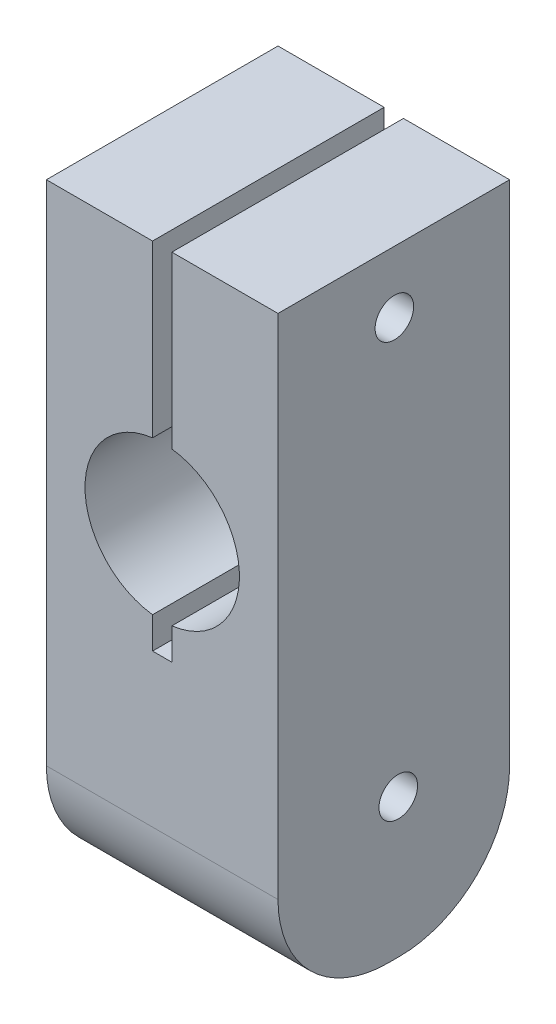
ISO-10303-21;
HEADER;
FILE_DESCRIPTION(('STEP AP214'),'2;1');
FILE_NAME('part.step','',(''),(''),'','','');
FILE_SCHEMA(('AUTOMOTIVE_DESIGN { 1 0 10303 214 1 1 1 1 }'));
ENDSEC;
DATA;
#1=APPLICATION_CONTEXT('core data for automotive mechanical design processes');
#2=APPLICATION_PROTOCOL_DEFINITION('international standard','automotive_design',2000,#1);
#3=PRODUCT_CONTEXT('',#1,'mechanical');
#4=PRODUCT('Part','Part','',(#3));
#5=PRODUCT_RELATED_PRODUCT_CATEGORY('part','',(#4));
#6=PRODUCT_DEFINITION_FORMATION('','',#4);
#7=PRODUCT_DEFINITION_CONTEXT('part definition',#1,'design');
#8=PRODUCT_DEFINITION('design','',#6,#7);
#9=PRODUCT_DEFINITION_SHAPE('','',#8);
#10=(LENGTH_UNIT() NAMED_UNIT(*) SI_UNIT(.MILLI.,.METRE.));
#11=(NAMED_UNIT(*) PLANE_ANGLE_UNIT() SI_UNIT($,.RADIAN.));
#12=(NAMED_UNIT(*) SI_UNIT($,.STERADIAN.) SOLID_ANGLE_UNIT());
#13=UNCERTAINTY_MEASURE_WITH_UNIT(LENGTH_MEASURE(1.E-05),#10,'distance_accuracy_value','');
#14=(GEOMETRIC_REPRESENTATION_CONTEXT(3) GLOBAL_UNCERTAINTY_ASSIGNED_CONTEXT((#13)) GLOBAL_UNIT_ASSIGNED_CONTEXT((#10,
#11,#12)) REPRESENTATION_CONTEXT('',''));
#15=CARTESIAN_POINT('',(0.,0.,0.));
#16=DIRECTION('',(0.,0.,1.));
#17=DIRECTION('',(1.,0.,0.));
#18=AXIS2_PLACEMENT_3D('',#15,#16,#17);
#19=CARTESIAN_POINT('',(0.79375,21.59,-9.525));
#20=DIRECTION('',(1.,0.,0.));
#21=DIRECTION('',(0.,0.,-1.));
#22=AXIS2_PLACEMENT_3D('',#19,#20,#21);
#23=PLANE('',#22);
#24=CARTESIAN_POINT('',(0.793749999999999,45.7202220572897,-0.0474979236769172));
#25=DIRECTION('',(1.,0.,0.));
#26=DIRECTION('',(0.,0.,-1.));
#27=AXIS2_PLACEMENT_3D('',#24,#25,#26);
#28=CIRCLE('',#27,1.5875);
#29=CARTESIAN_POINT('',(0.793749999999999,45.7202220572897,-1.63499792367692));
#30=VERTEX_POINT('',#29);
#31=EDGE_CURVE('E250',#30,#30,#28,.T.);
#32=ORIENTED_EDGE('',*,*,#31,.T.);
#33=EDGE_LOOP('',(#32));
#34=FACE_BOUND('',#33,.T.);
#35=DIRECTION('',(0.,1.,0.));
#36=VECTOR('',#35,1.);
#37=CARTESIAN_POINT('',(0.79375,21.59,-9.525));
#38=LINE('',#37,#36);
#39=CARTESIAN_POINT('',(0.79375,36.7801953094726,-9.525));
#40=VERTEX_POINT('',#39);
#41=CARTESIAN_POINT('',(0.79375,50.8,-9.525));
#42=VERTEX_POINT('',#41);
#43=EDGE_CURVE('E176',#40,#42,#38,.T.);
#44=ORIENTED_EDGE('',*,*,#43,.F.);
#45=DIRECTION('',(0.,0.,1.));
#46=VECTOR('',#45,1.);
#47=CARTESIAN_POINT('',(0.79375,36.7801953094726,-9.526));
#48=LINE('',#47,#46);
#49=CARTESIAN_POINT('',(0.79375,36.7801953094726,9.525));
#50=VERTEX_POINT('',#49);
#51=EDGE_CURVE('E255',#50,#40,#48,.F.);
#52=ORIENTED_EDGE('',*,*,#51,.F.);
#53=DIRECTION('',(0.,1.,0.));
#54=VECTOR('',#53,1.);
#55=CARTESIAN_POINT('',(0.79375,21.59,9.525));
#56=LINE('',#55,#54);
#57=CARTESIAN_POINT('',(0.79375,50.8,9.525));
#58=VERTEX_POINT('',#57);
#59=EDGE_CURVE('E164',#50,#58,#56,.T.);
#60=ORIENTED_EDGE('',*,*,#59,.T.);
#61=DIRECTION('',(0.,0.,-1.));
#62=VECTOR('',#61,1.);
#63=CARTESIAN_POINT('',(0.79375,50.8,-9.525));
#64=LINE('',#63,#62);
#65=EDGE_CURVE('E254',#58,#42,#64,.T.);
#66=ORIENTED_EDGE('',*,*,#65,.T.);
#67=EDGE_LOOP('',(#44,#52,#60,#66));
#68=FACE_BOUND('',#67,.T.);
#69=ADVANCED_FACE('F35',(#34,#68),#23,.F.);
#70=CARTESIAN_POINT('',(-0.79375,21.59,-9.525));
#71=DIRECTION('',(-1.,0.,0.));
#72=DIRECTION('',(0.,0.,1.));
#73=AXIS2_PLACEMENT_3D('',#70,#71,#72);
#74=PLANE('',#73);
#75=DIRECTION('',(0.,1.,0.));
#76=VECTOR('',#75,1.);
#77=CARTESIAN_POINT('',(-0.79375,21.59,-9.525));
#78=LINE('',#77,#76);
#79=CARTESIAN_POINT('',(-0.79375,21.59,-9.525));
#80=VERTEX_POINT('',#79);
#81=CARTESIAN_POINT('',(-0.79375,24.1798046905274,-9.525));
#82=VERTEX_POINT('',#81);
#83=EDGE_CURVE('E156',#80,#82,#78,.T.);
#84=ORIENTED_EDGE('',*,*,#83,.T.);
#85=DIRECTION('',(0.,0.,1.));
#86=VECTOR('',#85,1.);
#87=CARTESIAN_POINT('',(-0.79375,24.1798046905274,-9.526));
#88=LINE('',#87,#86);
#89=CARTESIAN_POINT('',(-0.79375,24.1798046905274,9.525));
#90=VERTEX_POINT('',#89);
#91=EDGE_CURVE('E141',#90,#82,#88,.F.);
#92=ORIENTED_EDGE('',*,*,#91,.F.);
#93=DIRECTION('',(0.,1.,0.));
#94=VECTOR('',#93,1.);
#95=CARTESIAN_POINT('',(-0.79375,21.59,9.525));
#96=LINE('',#95,#94);
#97=CARTESIAN_POINT('',(-0.79375,21.59,9.525));
#98=VERTEX_POINT('',#97);
#99=EDGE_CURVE('E153',#98,#90,#96,.T.);
#100=ORIENTED_EDGE('',*,*,#99,.F.);
#101=DIRECTION('',(0.,0.,1.));
#102=VECTOR('',#101,1.);
#103=CARTESIAN_POINT('',(-0.79375,21.59,-9.525));
#104=LINE('',#103,#102);
#105=EDGE_CURVE('E266',#80,#98,#104,.T.);
#106=ORIENTED_EDGE('',*,*,#105,.F.);
#107=EDGE_LOOP('',(#84,#92,#100,#106));
#108=FACE_BOUND('',#107,.T.);
#109=ADVANCED_FACE('F152',(#108),#74,.F.);
#110=CARTESIAN_POINT('',(0.,50.8,0.));
#111=DIRECTION('',(0.,1.,0.));
#112=DIRECTION('',(0.,0.,1.));
#113=AXIS2_PLACEMENT_3D('',#110,#111,#112);
#114=PLANE('',#113);
#115=ORIENTED_EDGE('',*,*,#65,.F.);
#116=DIRECTION('',(1.,0.,0.));
#117=VECTOR('',#116,1.);
#118=CARTESIAN_POINT('',(-9.52499999999998,50.8,9.525));
#119=LINE('',#118,#117);
#120=CARTESIAN_POINT('',(9.52500000000001,50.8,9.525));
#121=VERTEX_POINT('',#120);
#122=EDGE_CURVE('E187',#58,#121,#119,.T.);
#123=ORIENTED_EDGE('',*,*,#122,.T.);
#124=DIRECTION('',(0.,0.,-1.));
#125=VECTOR('',#124,1.);
#126=CARTESIAN_POINT('',(9.52500000000001,50.8,-9.525));
#127=LINE('',#126,#125);
#128=CARTESIAN_POINT('',(9.52500000000001,50.8,-9.525));
#129=VERTEX_POINT('',#128);
#130=EDGE_CURVE('E177',#121,#129,#127,.T.);
#131=ORIENTED_EDGE('',*,*,#130,.T.);
#132=DIRECTION('',(-1.,0.,0.));
#133=VECTOR('',#132,1.);
#134=CARTESIAN_POINT('',(-9.52499999999998,50.8,-9.525));
#135=LINE('',#134,#133);
#136=EDGE_CURVE('E182',#129,#42,#135,.T.);
#137=ORIENTED_EDGE('',*,*,#136,.T.);
#138=EDGE_LOOP('',(#115,#123,#131,#137));
#139=FACE_BOUND('',#138,.T.);
#140=ADVANCED_FACE('F277',(#139),#114,.T.);
#141=CARTESIAN_POINT('',(9.52500000000001,50.8,-9.525));
#142=DIRECTION('',(-1.,0.,0.));
#143=DIRECTION('',(0.,0.,1.));
#144=AXIS2_PLACEMENT_3D('',#141,#142,#143);
#145=PLANE('',#144);
#146=CARTESIAN_POINT('',(9.52500000000001,45.7202220572897,-0.0474979236769172));
#147=DIRECTION('',(1.,0.,0.));
#148=DIRECTION('',(0.,0.,-1.));
#149=AXIS2_PLACEMENT_3D('',#146,#147,#148);
#150=CIRCLE('',#149,1.5875);
#151=CARTESIAN_POINT('',(9.52500000000001,45.7202220572897,-1.63499792367692));
#152=VERTEX_POINT('',#151);
#153=EDGE_CURVE('E332',#152,#152,#150,.T.);
#154=ORIENTED_EDGE('',*,*,#153,.F.);
#155=EDGE_LOOP('',(#154));
#156=FACE_BOUND('',#155,.T.);
#157=CARTESIAN_POINT('',(9.52500000000001,11.4317209439949,-0.368108908496109));
#158=DIRECTION('',(1.,0.,0.));
#159=DIRECTION('',(0.,0.,-1.));
#160=AXIS2_PLACEMENT_3D('',#157,#158,#159);
#161=CIRCLE('',#160,1.5875);
#162=CARTESIAN_POINT('',(9.52500000000001,11.4317209439949,-1.95560890849611));
#163=VERTEX_POINT('',#162);
#164=EDGE_CURVE('E335',#163,#163,#161,.T.);
#165=ORIENTED_EDGE('',*,*,#164,.F.);
#166=EDGE_LOOP('',(#165));
#167=FACE_BOUND('',#166,.T.);
#168=DIRECTION('',(0.,0.,-1.));
#169=VECTOR('',#168,1.);
#170=CARTESIAN_POINT('',(9.52500000000001,0.,-9.525));
#171=LINE('',#170,#169);
#172=CARTESIAN_POINT('',(9.52500000000001,0.,0.474999999999998));
#173=VERTEX_POINT('',#172);
#174=CARTESIAN_POINT('',(9.52500000000001,0.,-0.474999999999998));
#175=VERTEX_POINT('',#174);
#176=EDGE_CURVE('E192',#173,#175,#171,.T.);
#177=ORIENTED_EDGE('',*,*,#176,.T.);
#178=CARTESIAN_POINT('',(9.52500000000001,9.05,-0.474999999999998));
#179=DIRECTION('',(-1.,0.,0.));
#180=DIRECTION('',(0.,0.,1.));
#181=AXIS2_PLACEMENT_3D('',#178,#179,#180);
#182=CIRCLE('',#181,9.05);
#183=CARTESIAN_POINT('',(9.52500000000001,9.05,-9.525));
#184=VERTEX_POINT('',#183);
#185=EDGE_CURVE('E44',#175,#184,#182,.F.);
#186=ORIENTED_EDGE('',*,*,#185,.T.);
#187=DIRECTION('',(0.,-1.,0.));
#188=VECTOR('',#187,1.);
#189=CARTESIAN_POINT('',(9.52500000000001,50.8,-9.525));
#190=LINE('',#189,#188);
#191=EDGE_CURVE('E203',#129,#184,#190,.T.);
#192=ORIENTED_EDGE('',*,*,#191,.F.);
#193=ORIENTED_EDGE('',*,*,#130,.F.);
#194=DIRECTION('',(0.,-1.,0.));
#195=VECTOR('',#194,1.);
#196=CARTESIAN_POINT('',(9.52500000000001,50.8,9.525));
#197=LINE('',#196,#195);
#198=CARTESIAN_POINT('',(9.52500000000001,9.05,9.525));
#199=VERTEX_POINT('',#198);
#200=EDGE_CURVE('E191',#121,#199,#197,.T.);
#201=ORIENTED_EDGE('',*,*,#200,.T.);
#202=CARTESIAN_POINT('',(9.52500000000001,9.05,0.474999999999998));
#203=DIRECTION('',(-1.,0.,0.));
#204=DIRECTION('',(0.,0.,1.));
#205=AXIS2_PLACEMENT_3D('',#202,#203,#204);
#206=CIRCLE('',#205,9.05);
#207=EDGE_CURVE('E51',#199,#173,#206,.F.);
#208=ORIENTED_EDGE('',*,*,#207,.T.);
#209=EDGE_LOOP('',(#177,#186,#192,#193,#201,#208));
#210=FACE_BOUND('',#209,.T.);
#211=ADVANCED_FACE('F220',(#156,#167,#210),#145,.F.);
#212=CARTESIAN_POINT('',(-9.52499999999998,50.8,-9.525));
#213=DIRECTION('',(0.,0.,1.));
#214=DIRECTION('',(1.,0.,0.));
#215=AXIS2_PLACEMENT_3D('',#212,#213,#214);
#216=PLANE('',#215);
#217=ORIENTED_EDGE('',*,*,#191,.T.);
#218=DIRECTION('',(-1.,0.,0.));
#219=VECTOR('',#218,1.);
#220=CARTESIAN_POINT('',(-9.52499999999998,9.05,-9.525));
#221=LINE('',#220,#219);
#222=CARTESIAN_POINT('',(-9.52499999999998,9.05,-9.525));
#223=VERTEX_POINT('',#222);
#224=EDGE_CURVE('E206',#184,#223,#221,.T.);
#225=ORIENTED_EDGE('',*,*,#224,.T.);
#226=DIRECTION('',(0.,-1.,0.));
#227=VECTOR('',#226,1.);
#228=CARTESIAN_POINT('',(-9.52499999999998,50.8,-9.525));
#229=LINE('',#228,#227);
#230=CARTESIAN_POINT('',(-9.52499999999998,50.8,-9.525));
#231=VERTEX_POINT('',#230);
#232=EDGE_CURVE('E200',#231,#223,#229,.T.);
#233=ORIENTED_EDGE('',*,*,#232,.F.);
#234=CARTESIAN_POINT('',(-0.793749999999999,50.8,-9.525));
#235=VERTEX_POINT('',#234);
#236=EDGE_CURVE('E180',#235,#231,#135,.T.);
#237=ORIENTED_EDGE('',*,*,#236,.F.);
#238=CARTESIAN_POINT('',(-0.79375,36.7801953094725,-9.525));
#239=VERTEX_POINT('',#238);
#240=EDGE_CURVE('E172',#239,#235,#78,.T.);
#241=ORIENTED_EDGE('',*,*,#240,.F.);
#242=CARTESIAN_POINT('',(0.,30.48,-9.525));
#243=DIRECTION('',(0.,0.,1.));
#244=DIRECTION('',(1.,0.,0.));
#245=AXIS2_PLACEMENT_3D('',#242,#243,#244);
#246=CIRCLE('',#245,6.35);
#247=EDGE_CURVE('E148',#82,#239,#246,.F.);
#248=ORIENTED_EDGE('',*,*,#247,.F.);
#249=ORIENTED_EDGE('',*,*,#83,.F.);
#250=DIRECTION('',(-1.,0.,0.));
#251=VECTOR('',#250,1.);
#252=CARTESIAN_POINT('',(-0.79375,21.59,-9.525));
#253=LINE('',#252,#251);
#254=CARTESIAN_POINT('',(0.79375,21.59,-9.525));
#255=VERTEX_POINT('',#254);
#256=EDGE_CURVE('E263',#255,#80,#253,.T.);
#257=ORIENTED_EDGE('',*,*,#256,.F.);
#258=CARTESIAN_POINT('',(0.79375,24.1798046905274,-9.525));
#259=VERTEX_POINT('',#258);
#260=EDGE_CURVE('E173',#255,#259,#38,.T.);
#261=ORIENTED_EDGE('',*,*,#260,.T.);
#262=CARTESIAN_POINT('',(0.,30.48,-9.525));
#263=DIRECTION('',(0.,0.,1.));
#264=DIRECTION('',(1.,0.,0.));
#265=AXIS2_PLACEMENT_3D('',#262,#263,#264);
#266=CIRCLE('',#265,6.35);
#267=EDGE_CURVE('E257',#40,#259,#266,.F.);
#268=ORIENTED_EDGE('',*,*,#267,.F.);
#269=ORIENTED_EDGE('',*,*,#43,.T.);
#270=ORIENTED_EDGE('',*,*,#136,.F.);
#271=EDGE_LOOP('',(#217,#225,#233,#237,#241,#248,#249,#257,#261,#268,#269,#270));
#272=FACE_BOUND('',#271,.T.);
#273=ADVANCED_FACE('F225',(#272),#216,.F.);
#274=CARTESIAN_POINT('',(-9.52499999999998,50.8,-9.525));
#275=DIRECTION('',(1.,0.,0.));
#276=DIRECTION('',(0.,0.,-1.));
#277=AXIS2_PLACEMENT_3D('',#274,#275,#276);
#278=PLANE('',#277);
#279=CARTESIAN_POINT('',(-9.52499999999998,45.7202220572897,-0.0474979236769172));
#280=DIRECTION('',(1.,0.,0.));
#281=DIRECTION('',(0.,0.,-1.));
#282=AXIS2_PLACEMENT_3D('',#279,#280,#281);
#283=CIRCLE('',#282,1.5875);
#284=CARTESIAN_POINT('',(-9.52499999999998,45.7202220572897,-1.63499792367692));
#285=VERTEX_POINT('',#284);
#286=EDGE_CURVE('E341',#285,#285,#283,.F.);
#287=ORIENTED_EDGE('',*,*,#286,.F.);
#288=EDGE_LOOP('',(#287));
#289=FACE_BOUND('',#288,.T.);
#290=CARTESIAN_POINT('',(-9.52499999999998,11.4317209439949,-0.368108908496109));
#291=DIRECTION('',(1.,0.,0.));
#292=DIRECTION('',(0.,0.,-1.));
#293=AXIS2_PLACEMENT_3D('',#290,#291,#292);
#294=CIRCLE('',#293,1.5875);
#295=CARTESIAN_POINT('',(-9.52499999999998,11.4317209439949,-1.95560890849611));
#296=VERTEX_POINT('',#295);
#297=EDGE_CURVE('E337',#296,#296,#294,.F.);
#298=ORIENTED_EDGE('',*,*,#297,.F.);
#299=EDGE_LOOP('',(#298));
#300=FACE_BOUND('',#299,.T.);
#301=ORIENTED_EDGE('',*,*,#232,.T.);
#302=CARTESIAN_POINT('',(-9.52499999999998,9.05,-0.474999999999998));
#303=DIRECTION('',(1.,0.,0.));
#304=DIRECTION('',(0.,0.,-1.));
#305=AXIS2_PLACEMENT_3D('',#302,#303,#304);
#306=CIRCLE('',#305,9.05);
#307=CARTESIAN_POINT('',(-9.52499999999998,0.,-0.474999999999998));
#308=VERTEX_POINT('',#307);
#309=EDGE_CURVE('E211',#223,#308,#306,.F.);
#310=ORIENTED_EDGE('',*,*,#309,.T.);
#311=DIRECTION('',(0.,0.,1.));
#312=VECTOR('',#311,1.);
#313=CARTESIAN_POINT('',(-9.52499999999998,0.,-9.525));
#314=LINE('',#313,#312);
#315=CARTESIAN_POINT('',(-9.52499999999998,0.,0.474999999999998));
#316=VERTEX_POINT('',#315);
#317=EDGE_CURVE('E181',#308,#316,#314,.T.);
#318=ORIENTED_EDGE('',*,*,#317,.T.);
#319=CARTESIAN_POINT('',(-9.52499999999998,9.05,0.474999999999998));
#320=DIRECTION('',(1.,0.,0.));
#321=DIRECTION('',(0.,0.,-1.));
#322=AXIS2_PLACEMENT_3D('',#319,#320,#321);
#323=CIRCLE('',#322,9.05);
#324=CARTESIAN_POINT('',(-9.52499999999998,9.05,9.525));
#325=VERTEX_POINT('',#324);
#326=EDGE_CURVE('E209',#316,#325,#323,.F.);
#327=ORIENTED_EDGE('',*,*,#326,.T.);
#328=DIRECTION('',(0.,-1.,0.));
#329=VECTOR('',#328,1.);
#330=CARTESIAN_POINT('',(-9.52499999999998,50.8,9.525));
#331=LINE('',#330,#329);
#332=CARTESIAN_POINT('',(-9.52499999999998,50.8,9.525));
#333=VERTEX_POINT('',#332);
#334=EDGE_CURVE('E198',#333,#325,#331,.T.);
#335=ORIENTED_EDGE('',*,*,#334,.F.);
#336=DIRECTION('',(0.,0.,1.));
#337=VECTOR('',#336,1.);
#338=CARTESIAN_POINT('',(-9.52499999999998,50.8,-9.525));
#339=LINE('',#338,#337);
#340=EDGE_CURVE('E185',#231,#333,#339,.T.);
#341=ORIENTED_EDGE('',*,*,#340,.F.);
#342=EDGE_LOOP('',(#301,#310,#318,#327,#335,#341));
#343=FACE_BOUND('',#342,.T.);
#344=ADVANCED_FACE('F229',(#289,#300,#343),#278,.F.);
#345=CARTESIAN_POINT('',(-9.52499999999998,50.8,9.525));
#346=DIRECTION('',(0.,0.,-1.));
#347=DIRECTION('',(-1.,0.,0.));
#348=AXIS2_PLACEMENT_3D('',#345,#346,#347);
#349=PLANE('',#348);
#350=ORIENTED_EDGE('',*,*,#334,.T.);
#351=DIRECTION('',(1.,0.,0.));
#352=VECTOR('',#351,1.);
#353=CARTESIAN_POINT('',(-9.52499999999998,9.05,9.525));
#354=LINE('',#353,#352);
#355=EDGE_CURVE('E11',#325,#199,#354,.T.);
#356=ORIENTED_EDGE('',*,*,#355,.T.);
#357=ORIENTED_EDGE('',*,*,#200,.F.);
#358=ORIENTED_EDGE('',*,*,#122,.F.);
#359=ORIENTED_EDGE('',*,*,#59,.F.);
#360=CARTESIAN_POINT('',(0.,30.48,9.525));
#361=DIRECTION('',(0.,0.,1.));
#362=DIRECTION('',(1.,0.,0.));
#363=AXIS2_PLACEMENT_3D('',#360,#361,#362);
#364=CIRCLE('',#363,6.35);
#365=CARTESIAN_POINT('',(0.79375,24.1798046905274,9.525));
#366=VERTEX_POINT('',#365);
#367=EDGE_CURVE('E245',#366,#50,#364,.T.);
#368=ORIENTED_EDGE('',*,*,#367,.F.);
#369=CARTESIAN_POINT('',(0.79375,21.59,9.525));
#370=VERTEX_POINT('',#369);
#371=EDGE_CURVE('E167',#370,#366,#56,.T.);
#372=ORIENTED_EDGE('',*,*,#371,.F.);
#373=DIRECTION('',(1.,0.,0.));
#374=VECTOR('',#373,1.);
#375=CARTESIAN_POINT('',(-0.79375,21.59,9.525));
#376=LINE('',#375,#374);
#377=EDGE_CURVE('E163',#98,#370,#376,.T.);
#378=ORIENTED_EDGE('',*,*,#377,.F.);
#379=ORIENTED_EDGE('',*,*,#99,.T.);
#380=CARTESIAN_POINT('',(0.,30.48,9.525));
#381=DIRECTION('',(0.,0.,1.));
#382=DIRECTION('',(1.,0.,0.));
#383=AXIS2_PLACEMENT_3D('',#380,#381,#382);
#384=CIRCLE('',#383,6.35);
#385=CARTESIAN_POINT('',(-0.79375,36.7801953094726,9.525));
#386=VERTEX_POINT('',#385);
#387=EDGE_CURVE('E138',#386,#90,#384,.T.);
#388=ORIENTED_EDGE('',*,*,#387,.F.);
#389=CARTESIAN_POINT('',(-0.79375,50.8,9.525));
#390=VERTEX_POINT('',#389);
#391=EDGE_CURVE('E165',#386,#390,#96,.T.);
#392=ORIENTED_EDGE('',*,*,#391,.T.);
#393=EDGE_CURVE('E188',#333,#390,#119,.T.);
#394=ORIENTED_EDGE('',*,*,#393,.F.);
#395=EDGE_LOOP('',(#350,#356,#357,#358,#359,#368,#372,#378,#379,#388,#392,#394));
#396=FACE_BOUND('',#395,.T.);
#397=ADVANCED_FACE('F160',(#396),#349,.F.);
#398=DIRECTION('',(0.,0.,1.));
#399=VECTOR('',#398,1.);
#400=CARTESIAN_POINT('',(-0.79375,50.8,-9.525));
#401=LINE('',#400,#399);
#402=EDGE_CURVE('E240',#235,#390,#401,.T.);
#403=ORIENTED_EDGE('',*,*,#402,.F.);
#404=ORIENTED_EDGE('',*,*,#236,.T.);
#405=ORIENTED_EDGE('',*,*,#340,.T.);
#406=ORIENTED_EDGE('',*,*,#393,.T.);
#407=EDGE_LOOP('',(#403,#404,#405,#406));
#408=FACE_BOUND('',#407,.T.);
#409=ADVANCED_FACE('F239',(#408),#114,.T.);
#410=CARTESIAN_POINT('',(0.,0.,0.));
#411=DIRECTION('',(0.,1.,0.));
#412=DIRECTION('',(0.,0.,1.));
#413=AXIS2_PLACEMENT_3D('',#410,#411,#412);
#414=PLANE('',#413);
#415=ORIENTED_EDGE('',*,*,#317,.F.);
#416=DIRECTION('',(-1.,0.,0.));
#417=VECTOR('',#416,1.);
#418=CARTESIAN_POINT('',(0.,0.,-0.474999999999998));
#419=LINE('',#418,#417);
#420=EDGE_CURVE('E58',#308,#175,#419,.F.);
#421=ORIENTED_EDGE('',*,*,#420,.T.);
#422=ORIENTED_EDGE('',*,*,#176,.F.);
#423=DIRECTION('',(1.,0.,0.));
#424=VECTOR('',#423,1.);
#425=CARTESIAN_POINT('',(0.,0.,0.474999999999998));
#426=LINE('',#425,#424);
#427=EDGE_CURVE('E213',#173,#316,#426,.F.);
#428=ORIENTED_EDGE('',*,*,#427,.T.);
#429=EDGE_LOOP('',(#415,#421,#422,#428));
#430=FACE_BOUND('',#429,.T.);
#431=ADVANCED_FACE('F232',(#430),#414,.F.);
#432=ORIENTED_EDGE('',*,*,#371,.T.);
#433=DIRECTION('',(0.,0.,1.));
#434=VECTOR('',#433,1.);
#435=CARTESIAN_POINT('',(0.79375,24.1798046905274,-9.526));
#436=LINE('',#435,#434);
#437=EDGE_CURVE('E247',#259,#366,#436,.T.);
#438=ORIENTED_EDGE('',*,*,#437,.F.);
#439=ORIENTED_EDGE('',*,*,#260,.F.);
#440=DIRECTION('',(0.,0.,-1.));
#441=VECTOR('',#440,1.);
#442=CARTESIAN_POINT('',(0.79375,21.59,-9.525));
#443=LINE('',#442,#441);
#444=EDGE_CURVE('E260',#370,#255,#443,.T.);
#445=ORIENTED_EDGE('',*,*,#444,.F.);
#446=EDGE_LOOP('',(#432,#438,#439,#445));
#447=FACE_BOUND('',#446,.T.);
#448=ADVANCED_FACE('F283',(#447),#23,.F.);
#449=CARTESIAN_POINT('',(-0.793749999999999,45.7202220572897,-0.0474979236769172));
#450=DIRECTION('',(-1.,0.,0.));
#451=DIRECTION('',(0.,0.,1.));
#452=AXIS2_PLACEMENT_3D('',#449,#450,#451);
#453=CIRCLE('',#452,1.5875);
#454=CARTESIAN_POINT('',(-0.793749999999999,45.7202220572897,1.54000207632308));
#455=VERTEX_POINT('',#454);
#456=EDGE_CURVE('E39',#455,#455,#453,.T.);
#457=ORIENTED_EDGE('',*,*,#456,.T.);
#458=EDGE_LOOP('',(#457));
#459=FACE_BOUND('',#458,.T.);
#460=ORIENTED_EDGE('',*,*,#391,.F.);
#461=DIRECTION('',(0.,0.,1.));
#462=VECTOR('',#461,1.);
#463=CARTESIAN_POINT('',(-0.79375,36.7801953094726,-9.526));
#464=LINE('',#463,#462);
#465=EDGE_CURVE('E144',#239,#386,#464,.T.);
#466=ORIENTED_EDGE('',*,*,#465,.F.);
#467=ORIENTED_EDGE('',*,*,#240,.T.);
#468=ORIENTED_EDGE('',*,*,#402,.T.);
#469=EDGE_LOOP('',(#460,#466,#467,#468));
#470=FACE_BOUND('',#469,.T.);
#471=ADVANCED_FACE('F244',(#459,#470),#74,.F.);
#472=CARTESIAN_POINT('',(0.,21.59,0.));
#473=DIRECTION('',(0.,1.,0.));
#474=DIRECTION('',(0.,0.,1.));
#475=AXIS2_PLACEMENT_3D('',#472,#473,#474);
#476=PLANE('',#475);
#477=ORIENTED_EDGE('',*,*,#444,.T.);
#478=ORIENTED_EDGE('',*,*,#256,.T.);
#479=ORIENTED_EDGE('',*,*,#105,.T.);
#480=ORIENTED_EDGE('',*,*,#377,.T.);
#481=EDGE_LOOP('',(#477,#478,#479,#480));
#482=FACE_BOUND('',#481,.T.);
#483=ADVANCED_FACE('F286',(#482),#476,.T.);
#484=CARTESIAN_POINT('',(0.,30.48,-9.526));
#485=DIRECTION('',(0.,0.,1.));
#486=DIRECTION('',(1.,0.,0.));
#487=AXIS2_PLACEMENT_3D('',#484,#485,#486);
#488=CYLINDRICAL_SURFACE('',#487,6.35);
#489=ORIENTED_EDGE('',*,*,#91,.T.);
#490=ORIENTED_EDGE('',*,*,#247,.T.);
#491=ORIENTED_EDGE('',*,*,#465,.T.);
#492=ORIENTED_EDGE('',*,*,#387,.T.);
#493=EDGE_LOOP('',(#489,#490,#491,#492));
#494=FACE_BOUND('',#493,.T.);
#495=ADVANCED_FACE('F140',(#494),#488,.F.);
#496=CARTESIAN_POINT('',(0.,30.48,-9.526));
#497=DIRECTION('',(0.,0.,1.));
#498=DIRECTION('',(1.,0.,0.));
#499=AXIS2_PLACEMENT_3D('',#496,#497,#498);
#500=CYLINDRICAL_SURFACE('',#499,6.35);
#501=ORIENTED_EDGE('',*,*,#51,.T.);
#502=ORIENTED_EDGE('',*,*,#267,.T.);
#503=ORIENTED_EDGE('',*,*,#437,.T.);
#504=ORIENTED_EDGE('',*,*,#367,.T.);
#505=EDGE_LOOP('',(#501,#502,#503,#504));
#506=FACE_BOUND('',#505,.T.);
#507=ADVANCED_FACE('F288',(#506),#500,.F.);
#508=CARTESIAN_POINT('',(-9.52499999999998,9.05,-0.474999999999998));
#509=DIRECTION('',(-1.,0.,0.));
#510=DIRECTION('',(0.,0.,1.));
#511=AXIS2_PLACEMENT_3D('',#508,#509,#510);
#512=CYLINDRICAL_SURFACE('',#511,9.05);
#513=ORIENTED_EDGE('',*,*,#185,.F.);
#514=ORIENTED_EDGE('',*,*,#420,.F.);
#515=ORIENTED_EDGE('',*,*,#309,.F.);
#516=ORIENTED_EDGE('',*,*,#224,.F.);
#517=EDGE_LOOP('',(#513,#514,#515,#516));
#518=FACE_BOUND('',#517,.T.);
#519=ADVANCED_FACE('F227',(#518),#512,.T.);
#520=CARTESIAN_POINT('',(-9.52499999999998,9.05,0.474999999999998));
#521=DIRECTION('',(1.,0.,0.));
#522=DIRECTION('',(0.,0.,-1.));
#523=AXIS2_PLACEMENT_3D('',#520,#521,#522);
#524=CYLINDRICAL_SURFACE('',#523,9.05);
#525=ORIENTED_EDGE('',*,*,#326,.F.);
#526=ORIENTED_EDGE('',*,*,#427,.F.);
#527=ORIENTED_EDGE('',*,*,#207,.F.);
#528=ORIENTED_EDGE('',*,*,#355,.F.);
#529=EDGE_LOOP('',(#525,#526,#527,#528));
#530=FACE_BOUND('',#529,.T.);
#531=ADVANCED_FACE('F37',(#530),#524,.T.);
#532=CARTESIAN_POINT('',(-14.0151280605346,45.7202220572897,-0.0474979236769172));
#533=DIRECTION('',(1.,0.,0.));
#534=DIRECTION('',(0.,0.,-1.));
#535=AXIS2_PLACEMENT_3D('',#532,#533,#534);
#536=CYLINDRICAL_SURFACE('',#535,1.5875);
#537=ORIENTED_EDGE('',*,*,#286,.T.);
#538=EDGE_LOOP('',(#537));
#539=FACE_BOUND('',#538,.T.);
#540=ORIENTED_EDGE('',*,*,#456,.F.);
#541=EDGE_LOOP('',(#540));
#542=FACE_BOUND('',#541,.T.);
#543=ADVANCED_FACE('F350',(#539,#542),#536,.F.);
#544=CARTESIAN_POINT('',(-14.0151280605346,11.4317209439949,-0.368108908496109));
#545=DIRECTION('',(1.,0.,0.));
#546=DIRECTION('',(0.,0.,-1.));
#547=AXIS2_PLACEMENT_3D('',#544,#545,#546);
#548=CYLINDRICAL_SURFACE('',#547,1.5875);
#549=ORIENTED_EDGE('',*,*,#297,.T.);
#550=EDGE_LOOP('',(#549));
#551=FACE_BOUND('',#550,.T.);
#552=ORIENTED_EDGE('',*,*,#164,.T.);
#553=EDGE_LOOP('',(#552));
#554=FACE_BOUND('',#553,.T.);
#555=ADVANCED_FACE('F348',(#551,#554),#548,.F.);
#556=ORIENTED_EDGE('',*,*,#153,.T.);
#557=EDGE_LOOP('',(#556));
#558=FACE_BOUND('',#557,.T.);
#559=ORIENTED_EDGE('',*,*,#31,.F.);
#560=EDGE_LOOP('',(#559));
#561=FACE_BOUND('',#560,.T.);
#562=ADVANCED_FACE('F345',(#558,#561),#536,.F.);
#563=CLOSED_SHELL('',(#69,#109,#140,#211,#273,#344,#397,#409,#431,#448,#471,#483,#495,#507,#519,
#531,#543,#555,#562));
#564=MANIFOLD_SOLID_BREP('B2',#563);
#565=ADVANCED_BREP_SHAPE_REPRESENTATION('',(#18,#564),#14);
#566=SHAPE_DEFINITION_REPRESENTATION(#9,#565);
ENDSEC;
END-ISO-10303-21;
